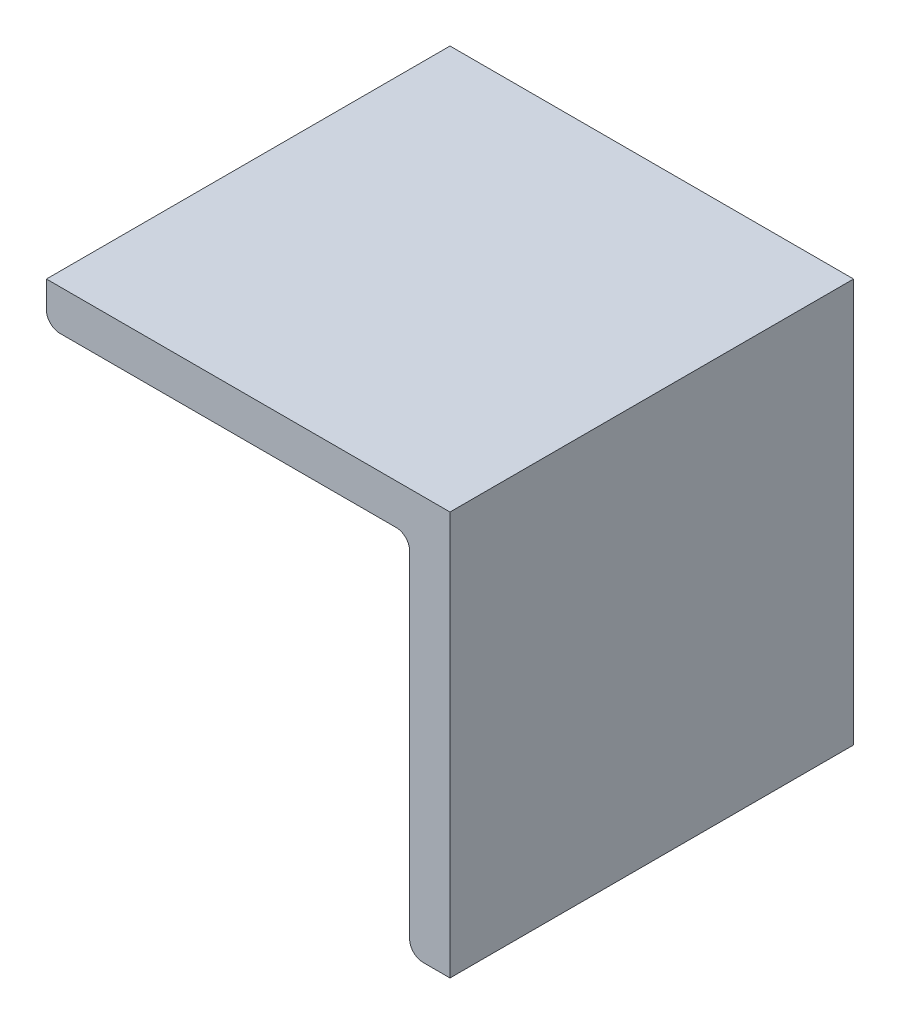
ISO-10303-21;
HEADER;
FILE_DESCRIPTION(('STEP AP214'),'2;1');
FILE_NAME('part.step','',(''),(''),'','','');
FILE_SCHEMA(('AUTOMOTIVE_DESIGN { 1 0 10303 214 1 1 1 1 }'));
ENDSEC;
DATA;
#1=APPLICATION_CONTEXT('core data for automotive mechanical design processes');
#2=APPLICATION_PROTOCOL_DEFINITION('international standard','automotive_design',2000,#1);
#3=PRODUCT_CONTEXT('',#1,'mechanical');
#4=PRODUCT('Part','Part','',(#3));
#5=PRODUCT_RELATED_PRODUCT_CATEGORY('part','',(#4));
#6=PRODUCT_DEFINITION_FORMATION('','',#4);
#7=PRODUCT_DEFINITION_CONTEXT('part definition',#1,'design');
#8=PRODUCT_DEFINITION('design','',#6,#7);
#9=PRODUCT_DEFINITION_SHAPE('','',#8);
#10=(LENGTH_UNIT() NAMED_UNIT(*) SI_UNIT(.MILLI.,.METRE.));
#11=(NAMED_UNIT(*) PLANE_ANGLE_UNIT() SI_UNIT($,.RADIAN.));
#12=(NAMED_UNIT(*) SI_UNIT($,.STERADIAN.) SOLID_ANGLE_UNIT());
#13=UNCERTAINTY_MEASURE_WITH_UNIT(LENGTH_MEASURE(1.E-05),#10,'distance_accuracy_value','');
#14=(GEOMETRIC_REPRESENTATION_CONTEXT(3) GLOBAL_UNCERTAINTY_ASSIGNED_CONTEXT((#13)) GLOBAL_UNIT_ASSIGNED_CONTEXT((#10,
#11,#12)) REPRESENTATION_CONTEXT('',''));
#15=CARTESIAN_POINT('',(0.,0.,0.));
#16=DIRECTION('',(0.,0.,1.));
#17=DIRECTION('',(1.,0.,0.));
#18=AXIS2_PLACEMENT_3D('',#15,#16,#17);
#19=CARTESIAN_POINT('',(0.,0.,30.));
#20=DIRECTION('',(-1.,0.,0.));
#21=DIRECTION('',(0.,-1.,0.));
#22=AXIS2_PLACEMENT_3D('',#19,#20,#21);
#23=PLANE('',#22);
#24=DIRECTION('',(0.,1.,0.));
#25=VECTOR('',#24,1.);
#26=CARTESIAN_POINT('',(0.,0.,0.));
#27=LINE('',#26,#25);
#28=CARTESIAN_POINT('',(0.,-30.,0.));
#29=VERTEX_POINT('',#28);
#30=CARTESIAN_POINT('',(0.,0.,0.));
#31=VERTEX_POINT('',#30);
#32=EDGE_CURVE('E129',#29,#31,#27,.T.);
#33=ORIENTED_EDGE('',*,*,#32,.T.);
#34=DIRECTION('',(0.,0.,-1.));
#35=VECTOR('',#34,1.);
#36=CARTESIAN_POINT('',(0.,0.,30.));
#37=LINE('',#36,#35);
#38=CARTESIAN_POINT('',(0.,0.,30.));
#39=VERTEX_POINT('',#38);
#40=EDGE_CURVE('E110',#39,#31,#37,.T.);
#41=ORIENTED_EDGE('',*,*,#40,.F.);
#42=DIRECTION('',(0.,1.,0.));
#43=VECTOR('',#42,1.);
#44=CARTESIAN_POINT('',(0.,0.,30.));
#45=LINE('',#44,#43);
#46=CARTESIAN_POINT('',(0.,-30.,30.));
#47=VERTEX_POINT('',#46);
#48=EDGE_CURVE('E116',#47,#39,#45,.T.);
#49=ORIENTED_EDGE('',*,*,#48,.F.);
#50=DIRECTION('',(0.,0.,-1.));
#51=VECTOR('',#50,1.);
#52=CARTESIAN_POINT('',(0.,-30.,30.));
#53=LINE('',#52,#51);
#54=EDGE_CURVE('E135',#47,#29,#53,.T.);
#55=ORIENTED_EDGE('',*,*,#54,.T.);
#56=EDGE_LOOP('',(#33,#41,#49,#55));
#57=FACE_BOUND('',#56,.T.);
#58=ADVANCED_FACE('F34',(#57),#23,.F.);
#59=CARTESIAN_POINT('',(0.,0.,30.));
#60=DIRECTION('',(0.,-1.,0.));
#61=DIRECTION('',(1.,0.,0.));
#62=AXIS2_PLACEMENT_3D('',#59,#60,#61);
#63=PLANE('',#62);
#64=DIRECTION('',(-1.,0.,0.));
#65=VECTOR('',#64,1.);
#66=CARTESIAN_POINT('',(0.,0.,0.));
#67=LINE('',#66,#65);
#68=CARTESIAN_POINT('',(-30.,0.,0.));
#69=VERTEX_POINT('',#68);
#70=EDGE_CURVE('E183',#31,#69,#67,.T.);
#71=ORIENTED_EDGE('',*,*,#70,.T.);
#72=DIRECTION('',(0.,0.,-1.));
#73=VECTOR('',#72,1.);
#74=CARTESIAN_POINT('',(-30.,0.,30.));
#75=LINE('',#74,#73);
#76=CARTESIAN_POINT('',(-30.,0.,30.));
#77=VERTEX_POINT('',#76);
#78=EDGE_CURVE('E113',#77,#69,#75,.T.);
#79=ORIENTED_EDGE('',*,*,#78,.F.);
#80=DIRECTION('',(-1.,0.,0.));
#81=VECTOR('',#80,1.);
#82=CARTESIAN_POINT('',(0.,0.,30.));
#83=LINE('',#82,#81);
#84=EDGE_CURVE('E106',#39,#77,#83,.T.);
#85=ORIENTED_EDGE('',*,*,#84,.F.);
#86=ORIENTED_EDGE('',*,*,#40,.T.);
#87=EDGE_LOOP('',(#71,#79,#85,#86));
#88=FACE_BOUND('',#87,.T.);
#89=ADVANCED_FACE('F108',(#88),#63,.F.);
#90=CARTESIAN_POINT('',(-30.,0.,30.));
#91=DIRECTION('',(1.,0.,0.));
#92=DIRECTION('',(0.,0.,-1.));
#93=AXIS2_PLACEMENT_3D('',#90,#91,#92);
#94=PLANE('',#93);
#95=DIRECTION('',(0.,-1.,0.));
#96=VECTOR('',#95,1.);
#97=CARTESIAN_POINT('',(-30.,0.,0.));
#98=LINE('',#97,#96);
#99=CARTESIAN_POINT('',(-30.,-2.,0.));
#100=VERTEX_POINT('',#99);
#101=EDGE_CURVE('E167',#69,#100,#98,.T.);
#102=ORIENTED_EDGE('',*,*,#101,.T.);
#103=DIRECTION('',(0.,0.,-1.));
#104=VECTOR('',#103,1.);
#105=CARTESIAN_POINT('',(-30.,-2.,30.));
#106=LINE('',#105,#104);
#107=CARTESIAN_POINT('',(-30.,-2.,30.));
#108=VERTEX_POINT('',#107);
#109=EDGE_CURVE('E154',#100,#108,#106,.F.);
#110=ORIENTED_EDGE('',*,*,#109,.T.);
#111=DIRECTION('',(0.,-1.,0.));
#112=VECTOR('',#111,1.);
#113=CARTESIAN_POINT('',(-30.,0.,30.));
#114=LINE('',#113,#112);
#115=EDGE_CURVE('E115',#77,#108,#114,.T.);
#116=ORIENTED_EDGE('',*,*,#115,.F.);
#117=ORIENTED_EDGE('',*,*,#78,.T.);
#118=EDGE_LOOP('',(#102,#110,#116,#117));
#119=FACE_BOUND('',#118,.T.);
#120=ADVANCED_FACE('F191',(#119),#94,.F.);
#121=CARTESIAN_POINT('',(-3.,-3.,30.));
#122=DIRECTION('',(0.,1.,0.));
#123=DIRECTION('',(-1.,0.,0.));
#124=AXIS2_PLACEMENT_3D('',#121,#122,#123);
#125=PLANE('',#124);
#126=DIRECTION('',(1.,0.,0.));
#127=VECTOR('',#126,1.);
#128=CARTESIAN_POINT('',(-3.,-3.,30.));
#129=LINE('',#128,#127);
#130=CARTESIAN_POINT('',(-29.,-3.,30.));
#131=VERTEX_POINT('',#130);
#132=CARTESIAN_POINT('',(-4.,-3.,30.));
#133=VERTEX_POINT('',#132);
#134=EDGE_CURVE('E173',#131,#133,#129,.T.);
#135=ORIENTED_EDGE('',*,*,#134,.F.);
#136=DIRECTION('',(0.,0.,-1.));
#137=VECTOR('',#136,1.);
#138=CARTESIAN_POINT('',(-29.,-3.,30.));
#139=LINE('',#138,#137);
#140=CARTESIAN_POINT('',(-29.,-3.,0.));
#141=VERTEX_POINT('',#140);
#142=EDGE_CURVE('E151',#131,#141,#139,.T.);
#143=ORIENTED_EDGE('',*,*,#142,.T.);
#144=DIRECTION('',(1.,0.,0.));
#145=VECTOR('',#144,1.);
#146=CARTESIAN_POINT('',(-3.,-3.,0.));
#147=LINE('',#146,#145);
#148=CARTESIAN_POINT('',(-4.,-3.,0.));
#149=VERTEX_POINT('',#148);
#150=EDGE_CURVE('E160',#141,#149,#147,.T.);
#151=ORIENTED_EDGE('',*,*,#150,.T.);
#152=DIRECTION('',(0.,0.,-1.));
#153=VECTOR('',#152,1.);
#154=CARTESIAN_POINT('',(-4.,-3.,30.));
#155=LINE('',#154,#153);
#156=EDGE_CURVE('E49',#149,#133,#155,.F.);
#157=ORIENTED_EDGE('',*,*,#156,.T.);
#158=EDGE_LOOP('',(#135,#143,#151,#157));
#159=FACE_BOUND('',#158,.T.);
#160=ADVANCED_FACE('F165',(#159),#125,.F.);
#161=CARTESIAN_POINT('',(-3.,-3.,30.));
#162=DIRECTION('',(1.,0.,0.));
#163=DIRECTION('',(0.,1.,0.));
#164=AXIS2_PLACEMENT_3D('',#161,#162,#163);
#165=PLANE('',#164);
#166=DIRECTION('',(0.,-1.,0.));
#167=VECTOR('',#166,1.);
#168=CARTESIAN_POINT('',(-3.,-3.,0.));
#169=LINE('',#168,#167);
#170=CARTESIAN_POINT('',(-3.,-4.,0.));
#171=VERTEX_POINT('',#170);
#172=CARTESIAN_POINT('',(-3.,-29.,0.));
#173=VERTEX_POINT('',#172);
#174=EDGE_CURVE('E162',#171,#173,#169,.T.);
#175=ORIENTED_EDGE('',*,*,#174,.T.);
#176=DIRECTION('',(0.,0.,-1.));
#177=VECTOR('',#176,1.);
#178=CARTESIAN_POINT('',(-3.,-29.,30.));
#179=LINE('',#178,#177);
#180=CARTESIAN_POINT('',(-3.,-29.,30.));
#181=VERTEX_POINT('',#180);
#182=EDGE_CURVE('E145',#173,#181,#179,.F.);
#183=ORIENTED_EDGE('',*,*,#182,.T.);
#184=DIRECTION('',(0.,-1.,0.));
#185=VECTOR('',#184,1.);
#186=CARTESIAN_POINT('',(-3.,-3.,30.));
#187=LINE('',#186,#185);
#188=CARTESIAN_POINT('',(-3.,-4.,30.));
#189=VERTEX_POINT('',#188);
#190=EDGE_CURVE('E171',#189,#181,#187,.T.);
#191=ORIENTED_EDGE('',*,*,#190,.F.);
#192=DIRECTION('',(0.,0.,-1.));
#193=VECTOR('',#192,1.);
#194=CARTESIAN_POINT('',(-3.,-4.,0.));
#195=LINE('',#194,#193);
#196=EDGE_CURVE('E142',#189,#171,#195,.T.);
#197=ORIENTED_EDGE('',*,*,#196,.T.);
#198=EDGE_LOOP('',(#175,#183,#191,#197));
#199=FACE_BOUND('',#198,.T.);
#200=ADVANCED_FACE('F175',(#199),#165,.F.);
#201=CARTESIAN_POINT('',(0.,-30.,30.));
#202=DIRECTION('',(0.,1.,0.));
#203=DIRECTION('',(0.,0.,1.));
#204=AXIS2_PLACEMENT_3D('',#201,#202,#203);
#205=PLANE('',#204);
#206=DIRECTION('',(1.,0.,0.));
#207=VECTOR('',#206,1.);
#208=CARTESIAN_POINT('',(0.,-30.,30.));
#209=LINE('',#208,#207);
#210=CARTESIAN_POINT('',(-2.,-30.,30.));
#211=VERTEX_POINT('',#210);
#212=EDGE_CURVE('E122',#211,#47,#209,.T.);
#213=ORIENTED_EDGE('',*,*,#212,.F.);
#214=DIRECTION('',(0.,0.,-1.));
#215=VECTOR('',#214,1.);
#216=CARTESIAN_POINT('',(-2.,-30.,30.));
#217=LINE('',#216,#215);
#218=CARTESIAN_POINT('',(-2.,-30.,0.));
#219=VERTEX_POINT('',#218);
#220=EDGE_CURVE('E130',#211,#219,#217,.T.);
#221=ORIENTED_EDGE('',*,*,#220,.T.);
#222=DIRECTION('',(1.,0.,0.));
#223=VECTOR('',#222,1.);
#224=CARTESIAN_POINT('',(0.,-30.,0.));
#225=LINE('',#224,#223);
#226=EDGE_CURVE('E126',#219,#29,#225,.T.);
#227=ORIENTED_EDGE('',*,*,#226,.T.);
#228=ORIENTED_EDGE('',*,*,#54,.F.);
#229=EDGE_LOOP('',(#213,#221,#227,#228));
#230=FACE_BOUND('',#229,.T.);
#231=ADVANCED_FACE('F216',(#230),#205,.F.);
#232=CARTESIAN_POINT('',(0.,0.,30.));
#233=DIRECTION('',(0.,0.,-1.));
#234=DIRECTION('',(-1.,0.,0.));
#235=AXIS2_PLACEMENT_3D('',#232,#233,#234);
#236=PLANE('',#235);
#237=ORIENTED_EDGE('',*,*,#190,.T.);
#238=CARTESIAN_POINT('',(-2.,-29.,30.));
#239=DIRECTION('',(0.,0.,-1.));
#240=DIRECTION('',(-1.,0.,0.));
#241=AXIS2_PLACEMENT_3D('',#238,#239,#240);
#242=CIRCLE('',#241,1.);
#243=EDGE_CURVE('E148',#181,#211,#242,.F.);
#244=ORIENTED_EDGE('',*,*,#243,.T.);
#245=ORIENTED_EDGE('',*,*,#212,.T.);
#246=ORIENTED_EDGE('',*,*,#48,.T.);
#247=ORIENTED_EDGE('',*,*,#84,.T.);
#248=ORIENTED_EDGE('',*,*,#115,.T.);
#249=CARTESIAN_POINT('',(-29.,-2.,30.));
#250=DIRECTION('',(0.,0.,-1.));
#251=DIRECTION('',(-1.,0.,0.));
#252=AXIS2_PLACEMENT_3D('',#249,#250,#251);
#253=CIRCLE('',#252,1.);
#254=EDGE_CURVE('E56',#108,#131,#253,.F.);
#255=ORIENTED_EDGE('',*,*,#254,.T.);
#256=ORIENTED_EDGE('',*,*,#134,.T.);
#257=CARTESIAN_POINT('',(-4.,-4.,30.));
#258=DIRECTION('',(0.,0.,-1.));
#259=DIRECTION('',(-1.,0.,0.));
#260=AXIS2_PLACEMENT_3D('',#257,#258,#259);
#261=CIRCLE('',#260,1.);
#262=EDGE_CURVE('E11',#133,#189,#261,.T.);
#263=ORIENTED_EDGE('',*,*,#262,.T.);
#264=EDGE_LOOP('',(#237,#244,#245,#246,#247,#248,#255,#256,#263));
#265=FACE_BOUND('',#264,.T.);
#266=ADVANCED_FACE('F120',(#265),#236,.F.);
#267=CARTESIAN_POINT('',(0.,0.,0.));
#268=DIRECTION('',(0.,0.,-1.));
#269=DIRECTION('',(-1.,0.,0.));
#270=AXIS2_PLACEMENT_3D('',#267,#268,#269);
#271=PLANE('',#270);
#272=ORIENTED_EDGE('',*,*,#226,.F.);
#273=CARTESIAN_POINT('',(-2.,-29.,0.));
#274=DIRECTION('',(0.,0.,-1.));
#275=DIRECTION('',(-1.,0.,0.));
#276=AXIS2_PLACEMENT_3D('',#273,#274,#275);
#277=CIRCLE('',#276,1.);
#278=EDGE_CURVE('E140',#219,#173,#277,.T.);
#279=ORIENTED_EDGE('',*,*,#278,.T.);
#280=ORIENTED_EDGE('',*,*,#174,.F.);
#281=CARTESIAN_POINT('',(-4.,-4.,0.));
#282=DIRECTION('',(0.,0.,-1.));
#283=DIRECTION('',(-1.,0.,0.));
#284=AXIS2_PLACEMENT_3D('',#281,#282,#283);
#285=CIRCLE('',#284,1.);
#286=EDGE_CURVE('E42',#171,#149,#285,.F.);
#287=ORIENTED_EDGE('',*,*,#286,.T.);
#288=ORIENTED_EDGE('',*,*,#150,.F.);
#289=CARTESIAN_POINT('',(-29.,-2.,0.));
#290=DIRECTION('',(0.,0.,-1.));
#291=DIRECTION('',(-1.,0.,0.));
#292=AXIS2_PLACEMENT_3D('',#289,#290,#291);
#293=CIRCLE('',#292,1.);
#294=EDGE_CURVE('E133',#141,#100,#293,.T.);
#295=ORIENTED_EDGE('',*,*,#294,.T.);
#296=ORIENTED_EDGE('',*,*,#101,.F.);
#297=ORIENTED_EDGE('',*,*,#70,.F.);
#298=ORIENTED_EDGE('',*,*,#32,.F.);
#299=EDGE_LOOP('',(#272,#279,#280,#287,#288,#295,#296,#297,#298));
#300=FACE_BOUND('',#299,.T.);
#301=ADVANCED_FACE('F159',(#300),#271,.T.);
#302=CARTESIAN_POINT('',(-2.,-29.,30.));
#303=DIRECTION('',(0.,0.,-1.));
#304=DIRECTION('',(-1.,0.,0.));
#305=AXIS2_PLACEMENT_3D('',#302,#303,#304);
#306=CYLINDRICAL_SURFACE('',#305,1.);
#307=ORIENTED_EDGE('',*,*,#243,.F.);
#308=ORIENTED_EDGE('',*,*,#182,.F.);
#309=ORIENTED_EDGE('',*,*,#278,.F.);
#310=ORIENTED_EDGE('',*,*,#220,.F.);
#311=EDGE_LOOP('',(#307,#308,#309,#310));
#312=FACE_BOUND('',#311,.T.);
#313=ADVANCED_FACE('F196',(#312),#306,.T.);
#314=CARTESIAN_POINT('',(-29.,-2.,30.));
#315=DIRECTION('',(0.,0.,-1.));
#316=DIRECTION('',(-1.,0.,0.));
#317=AXIS2_PLACEMENT_3D('',#314,#315,#316);
#318=CYLINDRICAL_SURFACE('',#317,1.);
#319=ORIENTED_EDGE('',*,*,#254,.F.);
#320=ORIENTED_EDGE('',*,*,#109,.F.);
#321=ORIENTED_EDGE('',*,*,#294,.F.);
#322=ORIENTED_EDGE('',*,*,#142,.F.);
#323=EDGE_LOOP('',(#319,#320,#321,#322));
#324=FACE_BOUND('',#323,.T.);
#325=ADVANCED_FACE('F194',(#324),#318,.T.);
#326=CARTESIAN_POINT('',(-4.,-4.,30.));
#327=DIRECTION('',(0.,0.,1.));
#328=DIRECTION('',(1.,0.,0.));
#329=AXIS2_PLACEMENT_3D('',#326,#327,#328);
#330=CYLINDRICAL_SURFACE('',#329,1.);
#331=ORIENTED_EDGE('',*,*,#262,.F.);
#332=ORIENTED_EDGE('',*,*,#156,.F.);
#333=ORIENTED_EDGE('',*,*,#286,.F.);
#334=ORIENTED_EDGE('',*,*,#196,.F.);
#335=EDGE_LOOP('',(#331,#332,#333,#334));
#336=FACE_BOUND('',#335,.T.);
#337=ADVANCED_FACE('F36',(#336),#330,.F.);
#338=CLOSED_SHELL('',(#58,#89,#120,#160,#200,#231,#266,#301,#313,#325,#337));
#339=MANIFOLD_SOLID_BREP('B2',#338);
#340=ADVANCED_BREP_SHAPE_REPRESENTATION('',(#18,#339),#14);
#341=SHAPE_DEFINITION_REPRESENTATION(#9,#340);
ENDSEC;
END-ISO-10303-21;
